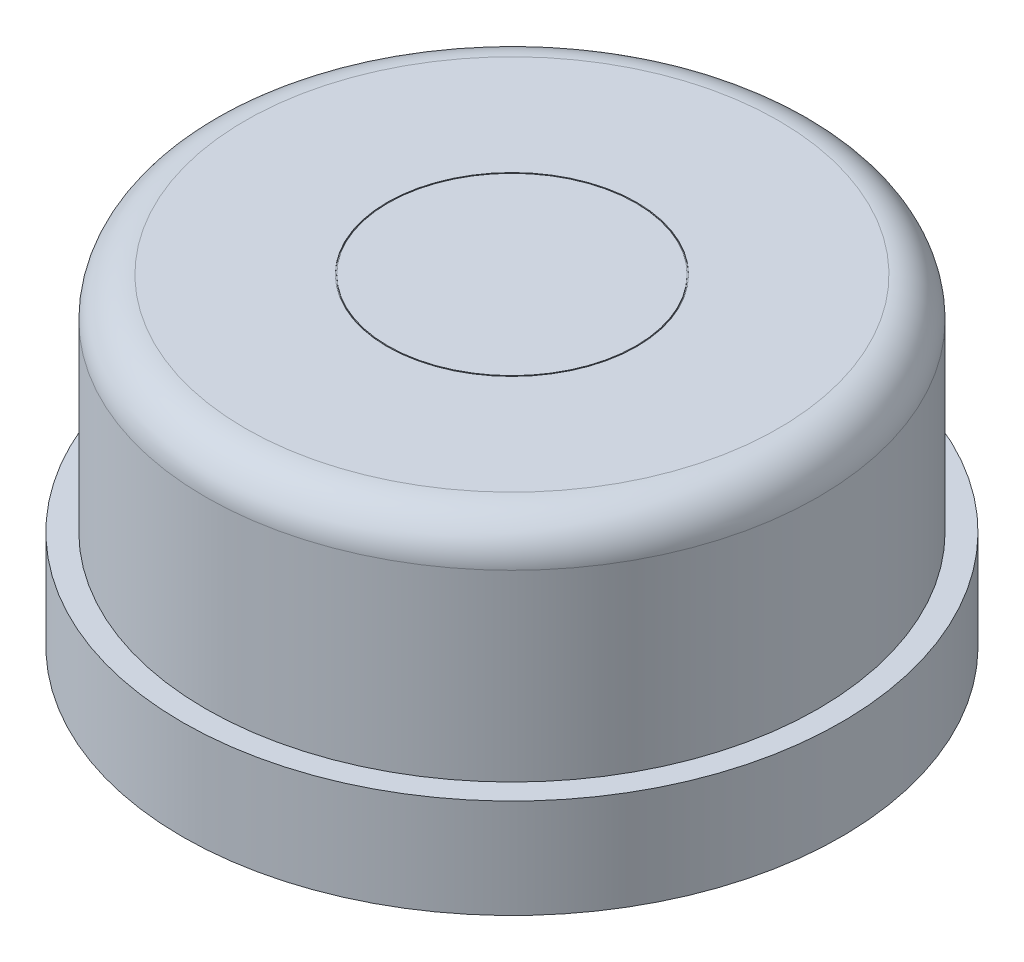
ISO-10303-21;
HEADER;
FILE_DESCRIPTION(('STEP AP214'),'2;1');
FILE_NAME('part.step','',(''),(''),'','','');
FILE_SCHEMA(('AUTOMOTIVE_DESIGN { 1 0 10303 214 1 1 1 1 }'));
ENDSEC;
DATA;
#1=APPLICATION_CONTEXT('core data for automotive mechanical design processes');
#2=APPLICATION_PROTOCOL_DEFINITION('international standard','automotive_design',2000,#1);
#3=PRODUCT_CONTEXT('',#1,'mechanical');
#4=PRODUCT('Part','Part','',(#3));
#5=PRODUCT_RELATED_PRODUCT_CATEGORY('part','',(#4));
#6=PRODUCT_DEFINITION_FORMATION('','',#4);
#7=PRODUCT_DEFINITION_CONTEXT('part definition',#1,'design');
#8=PRODUCT_DEFINITION('design','',#6,#7);
#9=PRODUCT_DEFINITION_SHAPE('','',#8);
#10=(LENGTH_UNIT() NAMED_UNIT(*) SI_UNIT(.MILLI.,.METRE.));
#11=(NAMED_UNIT(*) PLANE_ANGLE_UNIT() SI_UNIT($,.RADIAN.));
#12=(NAMED_UNIT(*) SI_UNIT($,.STERADIAN.) SOLID_ANGLE_UNIT());
#13=UNCERTAINTY_MEASURE_WITH_UNIT(LENGTH_MEASURE(1.E-05),#10,'distance_accuracy_value','');
#14=(GEOMETRIC_REPRESENTATION_CONTEXT(3) GLOBAL_UNCERTAINTY_ASSIGNED_CONTEXT((#13)) GLOBAL_UNIT_ASSIGNED_CONTEXT((#10,
#11,#12)) REPRESENTATION_CONTEXT('',''));
#15=CARTESIAN_POINT('',(0.,0.,0.));
#16=DIRECTION('',(0.,0.,1.));
#17=DIRECTION('',(1.,0.,0.));
#18=AXIS2_PLACEMENT_3D('',#15,#16,#17);
#19=CARTESIAN_POINT('',(0.,2.54,0.));
#20=DIRECTION('',(0.,1.,0.));
#21=DIRECTION('',(0.,0.,1.));
#22=AXIS2_PLACEMENT_3D('',#19,#20,#21);
#23=PLANE('',#22);
#24=CARTESIAN_POINT('',(0.,2.54,0.));
#25=DIRECTION('',(0.,1.,0.));
#26=DIRECTION('',(0.,0.,1.));
#27=AXIS2_PLACEMENT_3D('',#24,#25,#26);
#28=CIRCLE('',#27,8.4455);
#29=CARTESIAN_POINT('',(0.,2.54,8.4455));
#30=VERTEX_POINT('',#29);
#31=EDGE_CURVE('E48',#30,#30,#28,.T.);
#32=ORIENTED_EDGE('',*,*,#31,.T.);
#33=EDGE_LOOP('',(#32));
#34=FACE_BOUND('',#33,.T.);
#35=CARTESIAN_POINT('',(0.,2.54,0.));
#36=DIRECTION('',(0.,1.,0.));
#37=DIRECTION('',(0.,0.,1.));
#38=AXIS2_PLACEMENT_3D('',#35,#36,#37);
#39=CIRCLE('',#38,7.8486);
#40=CARTESIAN_POINT('',(0.,2.54,7.8486));
#41=VERTEX_POINT('',#40);
#42=EDGE_CURVE('E56',#41,#41,#39,.F.);
#43=ORIENTED_EDGE('',*,*,#42,.T.);
#44=EDGE_LOOP('',(#43));
#45=FACE_BOUND('',#44,.T.);
#46=ADVANCED_FACE('F37',(#34,#45),#23,.T.);
#47=CARTESIAN_POINT('',(0.,2.54,0.));
#48=DIRECTION('',(0.,-1.,0.));
#49=DIRECTION('',(0.,0.,-1.));
#50=AXIS2_PLACEMENT_3D('',#47,#48,#49);
#51=CYLINDRICAL_SURFACE('',#50,8.4455);
#52=ORIENTED_EDGE('',*,*,#31,.F.);
#53=EDGE_LOOP('',(#52));
#54=FACE_BOUND('',#53,.T.);
#55=CARTESIAN_POINT('',(0.,0.,0.));
#56=DIRECTION('',(0.,1.,0.));
#57=DIRECTION('',(0.,0.,1.));
#58=AXIS2_PLACEMENT_3D('',#55,#56,#57);
#59=CIRCLE('',#58,8.4455);
#60=CARTESIAN_POINT('',(0.,0.,8.4455));
#61=VERTEX_POINT('',#60);
#62=EDGE_CURVE('E52',#61,#61,#59,.T.);
#63=ORIENTED_EDGE('',*,*,#62,.T.);
#64=EDGE_LOOP('',(#63));
#65=FACE_BOUND('',#64,.T.);
#66=ADVANCED_FACE('F103',(#54,#65),#51,.T.);
#67=CARTESIAN_POINT('',(0.,0.,0.));
#68=DIRECTION('',(0.,1.,0.));
#69=DIRECTION('',(0.,0.,1.));
#70=AXIS2_PLACEMENT_3D('',#67,#68,#69);
#71=PLANE('',#70);
#72=ORIENTED_EDGE('',*,*,#62,.F.);
#73=EDGE_LOOP('',(#72));
#74=FACE_BOUND('',#73,.T.);
#75=ADVANCED_FACE('F98',(#74),#71,.F.);
#76=CARTESIAN_POINT('',(0.,8.255,0.));
#77=DIRECTION('',(0.,-1.,0.));
#78=DIRECTION('',(0.,0.,-1.));
#79=AXIS2_PLACEMENT_3D('',#76,#77,#78);
#80=CYLINDRICAL_SURFACE('',#79,7.8486);
#81=CARTESIAN_POINT('',(0.,7.239,0.));
#82=DIRECTION('',(0.,1.,0.));
#83=DIRECTION('',(0.,0.,1.));
#84=AXIS2_PLACEMENT_3D('',#81,#82,#83);
#85=CIRCLE('',#84,7.8486);
#86=CARTESIAN_POINT('',(0.,7.239,7.8486));
#87=VERTEX_POINT('',#86);
#88=EDGE_CURVE('E11',#87,#87,#85,.F.);
#89=ORIENTED_EDGE('',*,*,#88,.T.);
#90=EDGE_LOOP('',(#89));
#91=FACE_BOUND('',#90,.T.);
#92=ORIENTED_EDGE('',*,*,#42,.F.);
#93=EDGE_LOOP('',(#92));
#94=FACE_BOUND('',#93,.T.);
#95=ADVANCED_FACE('F90',(#91,#94),#80,.T.);
#96=CARTESIAN_POINT('',(0.,8.255,0.));
#97=DIRECTION('',(0.,1.,0.));
#98=DIRECTION('',(0.,0.,1.));
#99=AXIS2_PLACEMENT_3D('',#96,#97,#98);
#100=PLANE('',#99);
#101=CARTESIAN_POINT('',(0.,8.255,0.));
#102=DIRECTION('',(0.,1.,0.));
#103=DIRECTION('',(1.,0.,0.));
#104=AXIS2_PLACEMENT_3D('',#101,#102,#103);
#105=CIRCLE('',#104,3.2004);
#106=CARTESIAN_POINT('',(3.2004,8.255,0.));
#107=VERTEX_POINT('',#106);
#108=EDGE_CURVE('E61',#107,#107,#105,.T.);
#109=ORIENTED_EDGE('',*,*,#108,.F.);
#110=EDGE_LOOP('',(#109));
#111=FACE_BOUND('',#110,.T.);
#112=CARTESIAN_POINT('',(0.,8.255,0.));
#113=DIRECTION('',(0.,1.,0.));
#114=DIRECTION('',(0.,0.,1.));
#115=AXIS2_PLACEMENT_3D('',#112,#113,#114);
#116=CIRCLE('',#115,6.8326);
#117=CARTESIAN_POINT('',(0.,8.255,6.8326));
#118=VERTEX_POINT('',#117);
#119=EDGE_CURVE('E44',#118,#118,#116,.T.);
#120=ORIENTED_EDGE('',*,*,#119,.T.);
#121=EDGE_LOOP('',(#120));
#122=FACE_BOUND('',#121,.T.);
#123=ADVANCED_FACE('F88',(#111,#122),#100,.T.);
#124=CARTESIAN_POINT('',(0.,7.239,0.));
#125=DIRECTION('',(0.,1.,0.));
#126=DIRECTION('',(0.,0.,1.));
#127=AXIS2_PLACEMENT_3D('',#124,#125,#126);
#128=TOROIDAL_SURFACE('',#127,6.8326,1.016);
#129=ORIENTED_EDGE('',*,*,#88,.F.);
#130=EDGE_LOOP('',(#129));
#131=FACE_BOUND('',#130,.T.);
#132=ORIENTED_EDGE('',*,*,#119,.F.);
#133=EDGE_LOOP('',(#132));
#134=FACE_BOUND('',#133,.T.);
#135=ADVANCED_FACE('F39',(#131,#134),#128,.T.);
#136=CARTESIAN_POINT('',(0.,8.2296,0.));
#137=DIRECTION('',(0.,1.,0.));
#138=DIRECTION('',(0.,0.,1.));
#139=AXIS2_PLACEMENT_3D('',#136,#137,#138);
#140=CYLINDRICAL_SURFACE('',#139,3.2004);
#141=CARTESIAN_POINT('',(0.,8.2296,0.));
#142=DIRECTION('',(0.,1.,0.));
#143=DIRECTION('',(1.,0.,0.));
#144=AXIS2_PLACEMENT_3D('',#141,#142,#143);
#145=CIRCLE('',#144,3.2004);
#146=CARTESIAN_POINT('',(3.2004,8.2296,0.));
#147=VERTEX_POINT('',#146);
#148=EDGE_CURVE('E60',#147,#147,#145,.T.);
#149=ORIENTED_EDGE('',*,*,#148,.F.);
#150=EDGE_LOOP('',(#149));
#151=FACE_BOUND('',#150,.T.);
#152=ORIENTED_EDGE('',*,*,#108,.T.);
#153=EDGE_LOOP('',(#152));
#154=FACE_BOUND('',#153,.T.);
#155=ADVANCED_FACE('F79',(#151,#154),#140,.F.);
#156=CARTESIAN_POINT('',(0.,8.2296,0.));
#157=DIRECTION('',(0.,1.,0.));
#158=DIRECTION('',(0.,0.,1.));
#159=AXIS2_PLACEMENT_3D('',#156,#157,#158);
#160=PLANE('',#159);
#161=CARTESIAN_POINT('',(0.,8.2296,0.));
#162=DIRECTION('',(0.,1.,0.));
#163=DIRECTION('',(0.,0.,1.));
#164=AXIS2_PLACEMENT_3D('',#161,#162,#163);
#165=CIRCLE('',#164,3.175);
#166=CARTESIAN_POINT('',(0.,8.2296,3.175));
#167=VERTEX_POINT('',#166);
#168=EDGE_CURVE('E64',#167,#167,#165,.T.);
#169=ORIENTED_EDGE('',*,*,#168,.F.);
#170=EDGE_LOOP('',(#169));
#171=FACE_BOUND('',#170,.T.);
#172=ORIENTED_EDGE('',*,*,#148,.T.);
#173=EDGE_LOOP('',(#172));
#174=FACE_BOUND('',#173,.T.);
#175=ADVANCED_FACE('F76',(#171,#174),#160,.T.);
#176=CARTESIAN_POINT('',(0.,8.2296,0.));
#177=DIRECTION('',(0.,1.,0.));
#178=DIRECTION('',(0.,0.,1.));
#179=AXIS2_PLACEMENT_3D('',#176,#177,#178);
#180=CYLINDRICAL_SURFACE('',#179,3.175);
#181=ORIENTED_EDGE('',*,*,#168,.T.);
#182=EDGE_LOOP('',(#181));
#183=FACE_BOUND('',#182,.T.);
#184=CARTESIAN_POINT('',(0.,8.255,0.));
#185=DIRECTION('',(0.,1.,0.));
#186=DIRECTION('',(0.,0.,1.));
#187=AXIS2_PLACEMENT_3D('',#184,#185,#186);
#188=CIRCLE('',#187,3.175);
#189=CARTESIAN_POINT('',(0.,8.255,3.175));
#190=VERTEX_POINT('',#189);
#191=EDGE_CURVE('E67',#190,#190,#188,.T.);
#192=ORIENTED_EDGE('',*,*,#191,.F.);
#193=EDGE_LOOP('',(#192));
#194=FACE_BOUND('',#193,.T.);
#195=ADVANCED_FACE('F73',(#183,#194),#180,.T.);
#196=ORIENTED_EDGE('',*,*,#191,.T.);
#197=EDGE_LOOP('',(#196));
#198=FACE_BOUND('',#197,.T.);
#199=ADVANCED_FACE('F92',(#198),#100,.T.);
#200=CLOSED_SHELL('',(#46,#66,#75,#95,#123,#135,#155,#175,#195,#199));
#201=MANIFOLD_SOLID_BREP('B2',#200);
#202=ADVANCED_BREP_SHAPE_REPRESENTATION('',(#18,#201),#14);
#203=SHAPE_DEFINITION_REPRESENTATION(#9,#202);
ENDSEC;
END-ISO-10303-21;
